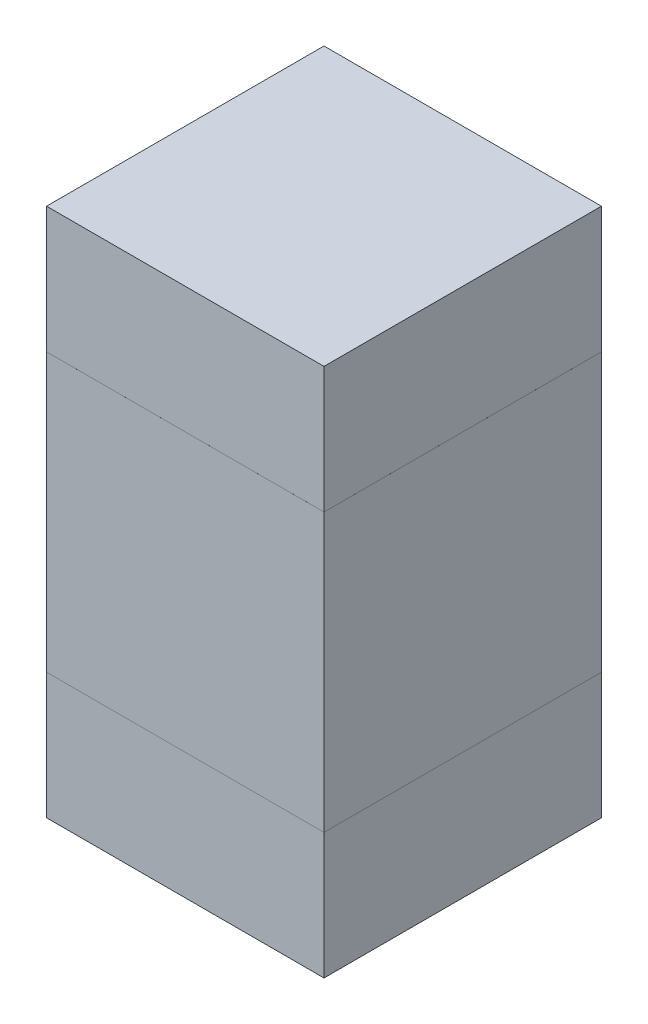
ISO-10303-21;
HEADER;
FILE_DESCRIPTION(('STEP AP214'),'2;1');
FILE_NAME('part.step','',(''),(''),'','','');
FILE_SCHEMA(('AUTOMOTIVE_DESIGN { 1 0 10303 214 1 1 1 1 }'));
ENDSEC;
DATA;
#1=APPLICATION_CONTEXT('core data for automotive mechanical design processes');
#2=APPLICATION_PROTOCOL_DEFINITION('international standard','automotive_design',2000,#1);
#3=PRODUCT_CONTEXT('',#1,'mechanical');
#4=PRODUCT('Part','Part','',(#3));
#5=PRODUCT_RELATED_PRODUCT_CATEGORY('part','',(#4));
#6=PRODUCT_DEFINITION_FORMATION('','',#4);
#7=PRODUCT_DEFINITION_CONTEXT('part definition',#1,'design');
#8=PRODUCT_DEFINITION('design','',#6,#7);
#9=PRODUCT_DEFINITION_SHAPE('','',#8);
#10=(LENGTH_UNIT() NAMED_UNIT(*) SI_UNIT(.MILLI.,.METRE.));
#11=(NAMED_UNIT(*) PLANE_ANGLE_UNIT() SI_UNIT($,.RADIAN.));
#12=(NAMED_UNIT(*) SI_UNIT($,.STERADIAN.) SOLID_ANGLE_UNIT());
#13=UNCERTAINTY_MEASURE_WITH_UNIT(LENGTH_MEASURE(1.E-05),#10,'distance_accuracy_value','');
#14=(GEOMETRIC_REPRESENTATION_CONTEXT(3) GLOBAL_UNCERTAINTY_ASSIGNED_CONTEXT((#13)) GLOBAL_UNIT_ASSIGNED_CONTEXT((#10,
#11,#12)) REPRESENTATION_CONTEXT('',''));
#15=CARTESIAN_POINT('',(0.,0.,0.));
#16=DIRECTION('',(0.,0.,1.));
#17=DIRECTION('',(1.,0.,0.));
#18=AXIS2_PLACEMENT_3D('',#15,#16,#17);
#19=CARTESIAN_POINT('',(9.704995246641,3.234999960195,0.32999934));
#20=DIRECTION('',(0.,0.,-1.));
#21=DIRECTION('',(0.,-1.,0.));
#22=AXIS2_PLACEMENT_3D('',#19,#20,#21);
#23=PLANE('',#22);
#24=DIRECTION('',(1.,0.,0.));
#25=VECTOR('',#24,1.);
#26=CARTESIAN_POINT('',(9.704995246641,3.234999960195,0.32999934));
#27=LINE('',#26,#25);
#28=CARTESIAN_POINT('',(9.704995246641,3.234999960195,0.32999934));
#29=VERTEX_POINT('',#28);
#30=CARTESIAN_POINT('',(10.034997126641,3.234999960195,0.32999934));
#31=VERTEX_POINT('',#30);
#32=EDGE_CURVE('P0_E98',#29,#31,#27,.T.);
#33=ORIENTED_EDGE('',*,*,#32,.T.);
#34=DIRECTION('',(0.,1.,0.));
#35=VECTOR('',#34,1.);
#36=CARTESIAN_POINT('',(10.034997126641,3.234999960195,0.32999934));
#37=LINE('',#36,#35);
#38=CARTESIAN_POINT('',(10.034997126641,3.564999300195,0.32999934));
#39=VERTEX_POINT('',#38);
#40=EDGE_CURVE('P0_E78',#31,#39,#37,.T.);
#41=ORIENTED_EDGE('',*,*,#40,.T.);
#42=DIRECTION('',(-1.,0.,0.));
#43=VECTOR('',#42,1.);
#44=CARTESIAN_POINT('',(10.034997126641,3.564999300195,0.32999934));
#45=LINE('',#44,#43);
#46=CARTESIAN_POINT('',(9.704995246641,3.564999300195,0.32999934));
#47=VERTEX_POINT('',#46);
#48=EDGE_CURVE('P0_E83',#39,#47,#45,.T.);
#49=ORIENTED_EDGE('',*,*,#48,.T.);
#50=DIRECTION('',(0.,-1.,0.));
#51=VECTOR('',#50,1.);
#52=CARTESIAN_POINT('',(9.704995246641,3.564999300195,0.32999934));
#53=LINE('',#52,#51);
#54=EDGE_CURVE('P0_E11',#47,#29,#53,.T.);
#55=ORIENTED_EDGE('',*,*,#54,.T.);
#56=EDGE_LOOP('',(#33,#41,#49,#55));
#57=FACE_BOUND('',#56,.T.);
#58=ADVANCED_FACE('P0_F17',(#57),#23,.F.);
#59=CARTESIAN_POINT('',(9.704995246641,3.234999960195,0.));
#60=DIRECTION('',(0.,0.,-1.));
#61=DIRECTION('',(0.,-1.,0.));
#62=AXIS2_PLACEMENT_3D('',#59,#60,#61);
#63=PLANE('',#62);
#64=DIRECTION('',(0.,-1.,0.));
#65=VECTOR('',#64,1.);
#66=CARTESIAN_POINT('',(9.704995246641,3.564999300195,0.));
#67=LINE('',#66,#65);
#68=CARTESIAN_POINT('',(9.704995246641,3.564999300195,0.));
#69=VERTEX_POINT('',#68);
#70=CARTESIAN_POINT('',(9.704995246641,3.234999960195,0.));
#71=VERTEX_POINT('',#70);
#72=EDGE_CURVE('P0_E20',#69,#71,#67,.T.);
#73=ORIENTED_EDGE('',*,*,#72,.F.);
#74=DIRECTION('',(-1.,0.,0.));
#75=VECTOR('',#74,1.);
#76=CARTESIAN_POINT('',(10.034997126641,3.564999300195,0.));
#77=LINE('',#76,#75);
#78=CARTESIAN_POINT('',(10.034997126641,3.564999300195,0.));
#79=VERTEX_POINT('',#78);
#80=EDGE_CURVE('P0_E68',#79,#69,#77,.T.);
#81=ORIENTED_EDGE('',*,*,#80,.F.);
#82=DIRECTION('',(0.,1.,0.));
#83=VECTOR('',#82,1.);
#84=CARTESIAN_POINT('',(10.034997126641,3.234999960195,0.));
#85=LINE('',#84,#83);
#86=CARTESIAN_POINT('',(10.034997126641,3.234999960195,0.));
#87=VERTEX_POINT('',#86);
#88=EDGE_CURVE('P0_E72',#87,#79,#85,.T.);
#89=ORIENTED_EDGE('',*,*,#88,.F.);
#90=DIRECTION('',(1.,0.,0.));
#91=VECTOR('',#90,1.);
#92=CARTESIAN_POINT('',(9.704995246641,3.234999960195,0.));
#93=LINE('',#92,#91);
#94=EDGE_CURVE('P0_E101',#71,#87,#93,.T.);
#95=ORIENTED_EDGE('',*,*,#94,.F.);
#96=EDGE_LOOP('',(#73,#81,#89,#95));
#97=FACE_BOUND('',#96,.T.);
#98=ADVANCED_FACE('P0_F70',(#97),#63,.T.);
#99=CARTESIAN_POINT('',(9.704995246641,3.564999300195,0.));
#100=DIRECTION('',(1.,0.,0.));
#101=DIRECTION('',(0.,1.,0.));
#102=AXIS2_PLACEMENT_3D('',#99,#100,#101);
#103=PLANE('',#102);
#104=ORIENTED_EDGE('',*,*,#72,.T.);
#105=DIRECTION('',(0.,0.,1.));
#106=VECTOR('',#105,1.);
#107=CARTESIAN_POINT('',(9.704995246641,3.234999960195,0.));
#108=LINE('',#107,#106);
#109=EDGE_CURVE('P0_E93',#71,#29,#108,.T.);
#110=ORIENTED_EDGE('',*,*,#109,.T.);
#111=ORIENTED_EDGE('',*,*,#54,.F.);
#112=DIRECTION('',(0.,0.,1.));
#113=VECTOR('',#112,1.);
#114=CARTESIAN_POINT('',(9.704995246641,3.564999300195,0.));
#115=LINE('',#114,#113);
#116=EDGE_CURVE('P0_E77',#69,#47,#115,.T.);
#117=ORIENTED_EDGE('',*,*,#116,.F.);
#118=EDGE_LOOP('',(#104,#110,#111,#117));
#119=FACE_BOUND('',#118,.T.);
#120=ADVANCED_FACE('P0_F118',(#119),#103,.F.);
#121=CARTESIAN_POINT('',(10.034997126641,3.564999300195,0.));
#122=DIRECTION('',(0.,-1.,0.));
#123=DIRECTION('',(0.,0.,-1.));
#124=AXIS2_PLACEMENT_3D('',#121,#122,#123);
#125=PLANE('',#124);
#126=ORIENTED_EDGE('',*,*,#80,.T.);
#127=ORIENTED_EDGE('',*,*,#116,.T.);
#128=ORIENTED_EDGE('',*,*,#48,.F.);
#129=DIRECTION('',(0.,0.,1.));
#130=VECTOR('',#129,1.);
#131=CARTESIAN_POINT('',(10.034997126641,3.564999300195,0.));
#132=LINE('',#131,#130);
#133=EDGE_CURVE('P0_E81',#79,#39,#132,.T.);
#134=ORIENTED_EDGE('',*,*,#133,.F.);
#135=EDGE_LOOP('',(#126,#127,#128,#134));
#136=FACE_BOUND('',#135,.T.);
#137=ADVANCED_FACE('P0_F82',(#136),#125,.F.);
#138=CARTESIAN_POINT('',(10.034997126641,3.234999960195,0.));
#139=DIRECTION('',(-1.,0.,0.));
#140=DIRECTION('',(0.,0.,1.));
#141=AXIS2_PLACEMENT_3D('',#138,#139,#140);
#142=PLANE('',#141);
#143=ORIENTED_EDGE('',*,*,#88,.T.);
#144=ORIENTED_EDGE('',*,*,#133,.T.);
#145=ORIENTED_EDGE('',*,*,#40,.F.);
#146=DIRECTION('',(0.,0.,1.));
#147=VECTOR('',#146,1.);
#148=CARTESIAN_POINT('',(10.034997126641,3.234999960195,0.));
#149=LINE('',#148,#147);
#150=EDGE_CURVE('P0_E90',#87,#31,#149,.T.);
#151=ORIENTED_EDGE('',*,*,#150,.F.);
#152=EDGE_LOOP('',(#143,#144,#145,#151));
#153=FACE_BOUND('',#152,.T.);
#154=ADVANCED_FACE('P0_F88',(#153),#142,.F.);
#155=CARTESIAN_POINT('',(9.704995246641,3.234999960195,0.));
#156=DIRECTION('',(0.,1.,0.));
#157=DIRECTION('',(1.,0.,0.));
#158=AXIS2_PLACEMENT_3D('',#155,#156,#157);
#159=PLANE('',#158);
#160=ORIENTED_EDGE('',*,*,#94,.T.);
#161=ORIENTED_EDGE('',*,*,#150,.T.);
#162=ORIENTED_EDGE('',*,*,#32,.F.);
#163=ORIENTED_EDGE('',*,*,#109,.F.);
#164=EDGE_LOOP('',(#160,#161,#162,#163));
#165=FACE_BOUND('',#164,.T.);
#166=ADVANCED_FACE('P0_F121',(#165),#159,.F.);
#167=CLOSED_SHELL('',(#58,#98,#120,#137,#154,#166));
#168=MANIFOLD_SOLID_BREP('P0_B1',#167);
#169=CARTESIAN_POINT('',(9.704995246641,3.085001916426,0.32999934));
#170=DIRECTION('',(0.,0.,-1.));
#171=DIRECTION('',(0.,-1.,0.));
#172=AXIS2_PLACEMENT_3D('',#169,#170,#171);
#173=PLANE('',#172);
#174=DIRECTION('',(1.,0.,0.));
#175=VECTOR('',#174,1.);
#176=CARTESIAN_POINT('',(9.704995246641,3.085001916426,0.32999934));
#177=LINE('',#176,#175);
#178=CARTESIAN_POINT('',(9.704995246641,3.085001916426,0.32999934));
#179=VERTEX_POINT('',#178);
#180=CARTESIAN_POINT('',(10.034997126641,3.085001916426,0.32999934));
#181=VERTEX_POINT('',#180);
#182=EDGE_CURVE('P1_E90',#179,#181,#177,.T.);
#183=ORIENTED_EDGE('',*,*,#182,.T.);
#184=DIRECTION('',(0.,1.,0.));
#185=VECTOR('',#184,1.);
#186=CARTESIAN_POINT('',(10.034997126641,3.085001916426,0.32999934));
#187=LINE('',#186,#185);
#188=CARTESIAN_POINT('',(10.034997126641,3.235001616426,0.32999934));
#189=VERTEX_POINT('',#188);
#190=EDGE_CURVE('P1_E85',#181,#189,#187,.T.);
#191=ORIENTED_EDGE('',*,*,#190,.T.);
#192=DIRECTION('',(-1.,0.,0.));
#193=VECTOR('',#192,1.);
#194=CARTESIAN_POINT('',(10.034997126641,3.235001616426,0.32999934));
#195=LINE('',#194,#193);
#196=CARTESIAN_POINT('',(9.704995246641,3.235001616426,0.32999934));
#197=VERTEX_POINT('',#196);
#198=EDGE_CURVE('P1_E109',#189,#197,#195,.T.);
#199=ORIENTED_EDGE('',*,*,#198,.T.);
#200=DIRECTION('',(0.,-1.,0.));
#201=VECTOR('',#200,1.);
#202=CARTESIAN_POINT('',(9.704995246641,3.235001616426,0.32999934));
#203=LINE('',#202,#201);
#204=EDGE_CURVE('P1_E11',#197,#179,#203,.T.);
#205=ORIENTED_EDGE('',*,*,#204,.T.);
#206=EDGE_LOOP('',(#183,#191,#199,#205));
#207=FACE_BOUND('',#206,.T.);
#208=ADVANCED_FACE('P1_F17',(#207),#173,.F.);
#209=CARTESIAN_POINT('',(9.704995246641,3.085001916426,0.));
#210=DIRECTION('',(0.,0.,-1.));
#211=DIRECTION('',(0.,-1.,0.));
#212=AXIS2_PLACEMENT_3D('',#209,#210,#211);
#213=PLANE('',#212);
#214=DIRECTION('',(0.,-1.,0.));
#215=VECTOR('',#214,1.);
#216=CARTESIAN_POINT('',(9.704995246641,3.235001616426,0.));
#217=LINE('',#216,#215);
#218=CARTESIAN_POINT('',(9.704995246641,3.235001616426,0.));
#219=VERTEX_POINT('',#218);
#220=CARTESIAN_POINT('',(9.704995246641,3.085001916426,0.));
#221=VERTEX_POINT('',#220);
#222=EDGE_CURVE('P1_E25',#219,#221,#217,.T.);
#223=ORIENTED_EDGE('',*,*,#222,.F.);
#224=DIRECTION('',(-1.,0.,0.));
#225=VECTOR('',#224,1.);
#226=CARTESIAN_POINT('',(10.034997126641,3.235001616426,0.));
#227=LINE('',#226,#225);
#228=CARTESIAN_POINT('',(10.034997126641,3.235001616426,0.));
#229=VERTEX_POINT('',#228);
#230=EDGE_CURVE('P1_E73',#229,#219,#227,.T.);
#231=ORIENTED_EDGE('',*,*,#230,.F.);
#232=DIRECTION('',(0.,1.,0.));
#233=VECTOR('',#232,1.);
#234=CARTESIAN_POINT('',(10.034997126641,3.085001916426,0.));
#235=LINE('',#234,#233);
#236=CARTESIAN_POINT('',(10.034997126641,3.085001916426,0.));
#237=VERTEX_POINT('',#236);
#238=EDGE_CURVE('P1_E67',#237,#229,#235,.T.);
#239=ORIENTED_EDGE('',*,*,#238,.F.);
#240=DIRECTION('',(1.,0.,0.));
#241=VECTOR('',#240,1.);
#242=CARTESIAN_POINT('',(9.704995246641,3.085001916426,0.));
#243=LINE('',#242,#241);
#244=EDGE_CURVE('P1_E71',#221,#237,#243,.T.);
#245=ORIENTED_EDGE('',*,*,#244,.F.);
#246=EDGE_LOOP('',(#223,#231,#239,#245));
#247=FACE_BOUND('',#246,.T.);
#248=ADVANCED_FACE('P1_F69',(#247),#213,.T.);
#249=CARTESIAN_POINT('',(9.704995246641,3.235001616426,0.));
#250=DIRECTION('',(1.,0.,0.));
#251=DIRECTION('',(0.,1.,0.));
#252=AXIS2_PLACEMENT_3D('',#249,#250,#251);
#253=PLANE('',#252);
#254=ORIENTED_EDGE('',*,*,#222,.T.);
#255=DIRECTION('',(0.,0.,1.));
#256=VECTOR('',#255,1.);
#257=CARTESIAN_POINT('',(9.704995246641,3.085001916426,0.));
#258=LINE('',#257,#256);
#259=EDGE_CURVE('P1_E79',#221,#179,#258,.T.);
#260=ORIENTED_EDGE('',*,*,#259,.T.);
#261=ORIENTED_EDGE('',*,*,#204,.F.);
#262=DIRECTION('',(0.,0.,1.));
#263=VECTOR('',#262,1.);
#264=CARTESIAN_POINT('',(9.704995246641,3.235001616426,0.));
#265=LINE('',#264,#263);
#266=EDGE_CURVE('P1_E108',#219,#197,#265,.T.);
#267=ORIENTED_EDGE('',*,*,#266,.F.);
#268=EDGE_LOOP('',(#254,#260,#261,#267));
#269=FACE_BOUND('',#268,.T.);
#270=ADVANCED_FACE('P1_F116',(#269),#253,.F.);
#271=CARTESIAN_POINT('',(10.034997126641,3.235001616426,0.));
#272=DIRECTION('',(0.,-1.,0.));
#273=DIRECTION('',(0.,0.,-1.));
#274=AXIS2_PLACEMENT_3D('',#271,#272,#273);
#275=PLANE('',#274);
#276=ORIENTED_EDGE('',*,*,#230,.T.);
#277=ORIENTED_EDGE('',*,*,#266,.T.);
#278=ORIENTED_EDGE('',*,*,#198,.F.);
#279=DIRECTION('',(0.,0.,1.));
#280=VECTOR('',#279,1.);
#281=CARTESIAN_POINT('',(10.034997126641,3.235001616426,0.));
#282=LINE('',#281,#280);
#283=EDGE_CURVE('P1_E78',#229,#189,#282,.T.);
#284=ORIENTED_EDGE('',*,*,#283,.F.);
#285=EDGE_LOOP('',(#276,#277,#278,#284));
#286=FACE_BOUND('',#285,.T.);
#287=ADVANCED_FACE('P1_F118',(#286),#275,.F.);
#288=CARTESIAN_POINT('',(10.034997126641,3.085001916426,0.));
#289=DIRECTION('',(-1.,0.,0.));
#290=DIRECTION('',(0.,0.,1.));
#291=AXIS2_PLACEMENT_3D('',#288,#289,#290);
#292=PLANE('',#291);
#293=ORIENTED_EDGE('',*,*,#238,.T.);
#294=ORIENTED_EDGE('',*,*,#283,.T.);
#295=ORIENTED_EDGE('',*,*,#190,.F.);
#296=DIRECTION('',(0.,0.,1.));
#297=VECTOR('',#296,1.);
#298=CARTESIAN_POINT('',(10.034997126641,3.085001916426,0.));
#299=LINE('',#298,#297);
#300=EDGE_CURVE('P1_E82',#237,#181,#299,.T.);
#301=ORIENTED_EDGE('',*,*,#300,.F.);
#302=EDGE_LOOP('',(#293,#294,#295,#301));
#303=FACE_BOUND('',#302,.T.);
#304=ADVANCED_FACE('P1_F83',(#303),#292,.F.);
#305=CARTESIAN_POINT('',(9.704995246641,3.085001916426,0.));
#306=DIRECTION('',(0.,1.,0.));
#307=DIRECTION('',(1.,0.,0.));
#308=AXIS2_PLACEMENT_3D('',#305,#306,#307);
#309=PLANE('',#308);
#310=ORIENTED_EDGE('',*,*,#244,.T.);
#311=ORIENTED_EDGE('',*,*,#300,.T.);
#312=ORIENTED_EDGE('',*,*,#182,.F.);
#313=ORIENTED_EDGE('',*,*,#259,.F.);
#314=EDGE_LOOP('',(#310,#311,#312,#313));
#315=FACE_BOUND('',#314,.T.);
#316=ADVANCED_FACE('P1_F93',(#315),#309,.F.);
#317=CLOSED_SHELL('',(#208,#248,#270,#287,#304,#316));
#318=MANIFOLD_SOLID_BREP('P1_B1',#317);
#319=CARTESIAN_POINT('',(9.704995246641,3.565005273359,0.32999934));
#320=DIRECTION('',(0.,0.,-1.));
#321=DIRECTION('',(0.,-1.,0.));
#322=AXIS2_PLACEMENT_3D('',#319,#320,#321);
#323=PLANE('',#322);
#324=DIRECTION('',(1.,0.,0.));
#325=VECTOR('',#324,1.);
#326=CARTESIAN_POINT('',(9.704995246641,3.565005273359,0.32999934));
#327=LINE('',#326,#325);
#328=CARTESIAN_POINT('',(9.704995246641,3.565005273359,0.32999934));
#329=VERTEX_POINT('',#328);
#330=CARTESIAN_POINT('',(10.034997126641,3.565005273359,0.32999934));
#331=VERTEX_POINT('',#330);
#332=EDGE_CURVE('P2_E90',#329,#331,#327,.T.);
#333=ORIENTED_EDGE('',*,*,#332,.T.);
#334=DIRECTION('',(0.,1.,0.));
#335=VECTOR('',#334,1.);
#336=CARTESIAN_POINT('',(10.034997126641,3.565005273359,0.32999934));
#337=LINE('',#336,#335);
#338=CARTESIAN_POINT('',(10.034997126641,3.715004973359,0.32999934));
#339=VERTEX_POINT('',#338);
#340=EDGE_CURVE('P2_E85',#331,#339,#337,.T.);
#341=ORIENTED_EDGE('',*,*,#340,.T.);
#342=DIRECTION('',(-1.,0.,0.));
#343=VECTOR('',#342,1.);
#344=CARTESIAN_POINT('',(10.034997126641,3.715004973359,0.32999934));
#345=LINE('',#344,#343);
#346=CARTESIAN_POINT('',(9.704995246641,3.715004973359,0.32999934));
#347=VERTEX_POINT('',#346);
#348=EDGE_CURVE('P2_E112',#339,#347,#345,.T.);
#349=ORIENTED_EDGE('',*,*,#348,.T.);
#350=DIRECTION('',(0.,-1.,0.));
#351=VECTOR('',#350,1.);
#352=CARTESIAN_POINT('',(9.704995246641,3.715004973359,0.32999934));
#353=LINE('',#352,#351);
#354=EDGE_CURVE('P2_E11',#347,#329,#353,.T.);
#355=ORIENTED_EDGE('',*,*,#354,.T.);
#356=EDGE_LOOP('',(#333,#341,#349,#355));
#357=FACE_BOUND('',#356,.T.);
#358=ADVANCED_FACE('P2_F17',(#357),#323,.F.);
#359=CARTESIAN_POINT('',(9.704995246641,3.565005273359,0.));
#360=DIRECTION('',(0.,0.,-1.));
#361=DIRECTION('',(0.,-1.,0.));
#362=AXIS2_PLACEMENT_3D('',#359,#360,#361);
#363=PLANE('',#362);
#364=DIRECTION('',(0.,-1.,0.));
#365=VECTOR('',#364,1.);
#366=CARTESIAN_POINT('',(9.704995246641,3.715004973359,0.));
#367=LINE('',#366,#365);
#368=CARTESIAN_POINT('',(9.704995246641,3.715004973359,0.));
#369=VERTEX_POINT('',#368);
#370=CARTESIAN_POINT('',(9.704995246641,3.565005273359,0.));
#371=VERTEX_POINT('',#370);
#372=EDGE_CURVE('P2_E20',#369,#371,#367,.T.);
#373=ORIENTED_EDGE('',*,*,#372,.F.);
#374=DIRECTION('',(-1.,0.,0.));
#375=VECTOR('',#374,1.);
#376=CARTESIAN_POINT('',(10.034997126641,3.715004973359,0.));
#377=LINE('',#376,#375);
#378=CARTESIAN_POINT('',(10.034997126641,3.715004973359,0.));
#379=VERTEX_POINT('',#378);
#380=EDGE_CURVE('P2_E73',#379,#369,#377,.T.);
#381=ORIENTED_EDGE('',*,*,#380,.F.);
#382=DIRECTION('',(0.,1.,0.));
#383=VECTOR('',#382,1.);
#384=CARTESIAN_POINT('',(10.034997126641,3.565005273359,0.));
#385=LINE('',#384,#383);
#386=CARTESIAN_POINT('',(10.034997126641,3.565005273359,0.));
#387=VERTEX_POINT('',#386);
#388=EDGE_CURVE('P2_E67',#387,#379,#385,.T.);
#389=ORIENTED_EDGE('',*,*,#388,.F.);
#390=DIRECTION('',(1.,0.,0.));
#391=VECTOR('',#390,1.);
#392=CARTESIAN_POINT('',(9.704995246641,3.565005273359,0.));
#393=LINE('',#392,#391);
#394=EDGE_CURVE('P2_E71',#371,#387,#393,.T.);
#395=ORIENTED_EDGE('',*,*,#394,.F.);
#396=EDGE_LOOP('',(#373,#381,#389,#395));
#397=FACE_BOUND('',#396,.T.);
#398=ADVANCED_FACE('P2_F69',(#397),#363,.T.);
#399=CARTESIAN_POINT('',(9.704995246641,3.715004973359,0.));
#400=DIRECTION('',(1.,0.,0.));
#401=DIRECTION('',(0.,1.,0.));
#402=AXIS2_PLACEMENT_3D('',#399,#400,#401);
#403=PLANE('',#402);
#404=ORIENTED_EDGE('',*,*,#372,.T.);
#405=DIRECTION('',(0.,0.,1.));
#406=VECTOR('',#405,1.);
#407=CARTESIAN_POINT('',(9.704995246641,3.565005273359,0.));
#408=LINE('',#407,#406);
#409=EDGE_CURVE('P2_E79',#371,#329,#408,.T.);
#410=ORIENTED_EDGE('',*,*,#409,.T.);
#411=ORIENTED_EDGE('',*,*,#354,.F.);
#412=DIRECTION('',(0.,0.,1.));
#413=VECTOR('',#412,1.);
#414=CARTESIAN_POINT('',(9.704995246641,3.715004973359,0.));
#415=LINE('',#414,#413);
#416=EDGE_CURVE('P2_E108',#369,#347,#415,.T.);
#417=ORIENTED_EDGE('',*,*,#416,.F.);
#418=EDGE_LOOP('',(#404,#410,#411,#417));
#419=FACE_BOUND('',#418,.T.);
#420=ADVANCED_FACE('P2_F119',(#419),#403,.F.);
#421=CARTESIAN_POINT('',(10.034997126641,3.715004973359,0.));
#422=DIRECTION('',(0.,-1.,0.));
#423=DIRECTION('',(0.,0.,-1.));
#424=AXIS2_PLACEMENT_3D('',#421,#422,#423);
#425=PLANE('',#424);
#426=ORIENTED_EDGE('',*,*,#380,.T.);
#427=ORIENTED_EDGE('',*,*,#416,.T.);
#428=ORIENTED_EDGE('',*,*,#348,.F.);
#429=DIRECTION('',(0.,0.,1.));
#430=VECTOR('',#429,1.);
#431=CARTESIAN_POINT('',(10.034997126641,3.715004973359,0.));
#432=LINE('',#431,#430);
#433=EDGE_CURVE('P2_E78',#379,#339,#432,.T.);
#434=ORIENTED_EDGE('',*,*,#433,.F.);
#435=EDGE_LOOP('',(#426,#427,#428,#434));
#436=FACE_BOUND('',#435,.T.);
#437=ADVANCED_FACE('P2_F121',(#436),#425,.F.);
#438=CARTESIAN_POINT('',(10.034997126641,3.565005273359,0.));
#439=DIRECTION('',(-1.,0.,0.));
#440=DIRECTION('',(0.,0.,1.));
#441=AXIS2_PLACEMENT_3D('',#438,#439,#440);
#442=PLANE('',#441);
#443=ORIENTED_EDGE('',*,*,#388,.T.);
#444=ORIENTED_EDGE('',*,*,#433,.T.);
#445=ORIENTED_EDGE('',*,*,#340,.F.);
#446=DIRECTION('',(0.,0.,1.));
#447=VECTOR('',#446,1.);
#448=CARTESIAN_POINT('',(10.034997126641,3.565005273359,0.));
#449=LINE('',#448,#447);
#450=EDGE_CURVE('P2_E82',#387,#331,#449,.T.);
#451=ORIENTED_EDGE('',*,*,#450,.F.);
#452=EDGE_LOOP('',(#443,#444,#445,#451));
#453=FACE_BOUND('',#452,.T.);
#454=ADVANCED_FACE('P2_F83',(#453),#442,.F.);
#455=CARTESIAN_POINT('',(9.704995246641,3.565005273359,0.));
#456=DIRECTION('',(0.,1.,0.));
#457=DIRECTION('',(1.,0.,0.));
#458=AXIS2_PLACEMENT_3D('',#455,#456,#457);
#459=PLANE('',#458);
#460=ORIENTED_EDGE('',*,*,#394,.T.);
#461=ORIENTED_EDGE('',*,*,#450,.T.);
#462=ORIENTED_EDGE('',*,*,#332,.F.);
#463=ORIENTED_EDGE('',*,*,#409,.F.);
#464=EDGE_LOOP('',(#460,#461,#462,#463));
#465=FACE_BOUND('',#464,.T.);
#466=ADVANCED_FACE('P2_F93',(#465),#459,.F.);
#467=CLOSED_SHELL('',(#358,#398,#420,#437,#454,#466));
#468=MANIFOLD_SOLID_BREP('P2_B1',#467);
#469=ADVANCED_BREP_SHAPE_REPRESENTATION('',(#18,#168,#318,#468),#14);
#470=SHAPE_DEFINITION_REPRESENTATION(#9,#469);
ENDSEC;
END-ISO-10303-21;
